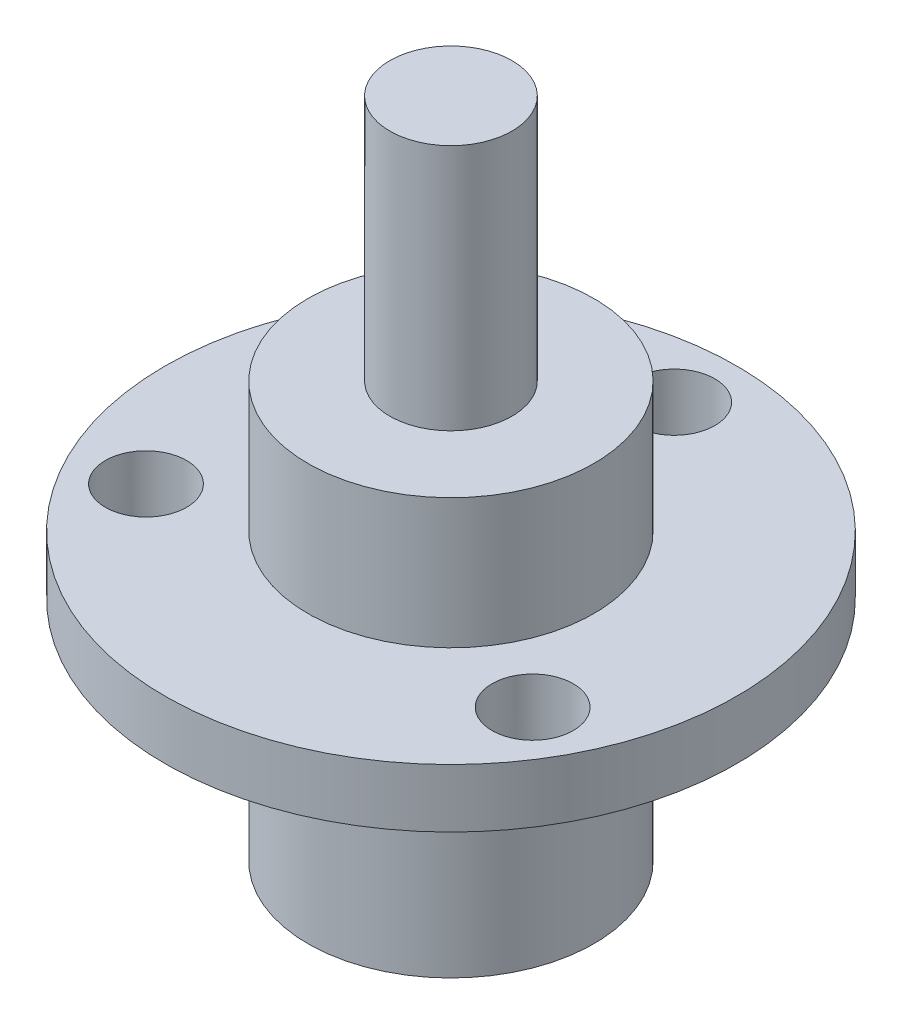
ISO-10303-21;
HEADER;
FILE_DESCRIPTION(('STEP AP214'),'2;1');
FILE_NAME('part.step','',(''),(''),'','','');
FILE_SCHEMA(('AUTOMOTIVE_DESIGN { 1 0 10303 214 1 1 1 1 }'));
ENDSEC;
DATA;
#1=APPLICATION_CONTEXT('core data for automotive mechanical design processes');
#2=APPLICATION_PROTOCOL_DEFINITION('international standard','automotive_design',2000,#1);
#3=PRODUCT_CONTEXT('',#1,'mechanical');
#4=PRODUCT('Part','Part','',(#3));
#5=PRODUCT_RELATED_PRODUCT_CATEGORY('part','',(#4));
#6=PRODUCT_DEFINITION_FORMATION('','',#4);
#7=PRODUCT_DEFINITION_CONTEXT('part definition',#1,'design');
#8=PRODUCT_DEFINITION('design','',#6,#7);
#9=PRODUCT_DEFINITION_SHAPE('','',#8);
#10=(LENGTH_UNIT() NAMED_UNIT(*) SI_UNIT(.MILLI.,.METRE.));
#11=(NAMED_UNIT(*) PLANE_ANGLE_UNIT() SI_UNIT($,.RADIAN.));
#12=(NAMED_UNIT(*) SI_UNIT($,.STERADIAN.) SOLID_ANGLE_UNIT());
#13=UNCERTAINTY_MEASURE_WITH_UNIT(LENGTH_MEASURE(1.E-05),#10,'distance_accuracy_value','');
#14=(GEOMETRIC_REPRESENTATION_CONTEXT(3) GLOBAL_UNCERTAINTY_ASSIGNED_CONTEXT((#13)) GLOBAL_UNIT_ASSIGNED_CONTEXT((#10,
#11,#12)) REPRESENTATION_CONTEXT('',''));
#15=CARTESIAN_POINT('',(0.,0.,0.));
#16=DIRECTION('',(0.,0.,1.));
#17=DIRECTION('',(1.,0.,0.));
#18=AXIS2_PLACEMENT_3D('',#15,#16,#17);
#19=CARTESIAN_POINT('',(0.,0.,0.));
#20=DIRECTION('',(0.,-1.,0.));
#21=DIRECTION('',(1.,0.,0.));
#22=AXIS2_PLACEMENT_3D('',#19,#20,#21);
#23=PLANE('',#22);
#24=CARTESIAN_POINT('',(0.,0.,0.));
#25=DIRECTION('',(0.,1.,0.));
#26=DIRECTION('',(-1.,0.,0.));
#27=AXIS2_PLACEMENT_3D('',#24,#25,#26);
#28=CIRCLE('',#27,5.588);
#29=CARTESIAN_POINT('',(-5.58799999999999,0.,0.));
#30=VERTEX_POINT('',#29);
#31=EDGE_CURVE('E10',#30,#30,#28,.T.);
#32=ORIENTED_EDGE('',*,*,#31,.F.);
#33=EDGE_LOOP('',(#32));
#34=FACE_BOUND('',#33,.T.);
#35=ADVANCED_FACE('F30',(#34),#23,.T.);
#36=CARTESIAN_POINT('',(0.,25.908,0.));
#37=DIRECTION('',(0.,1.,0.));
#38=DIRECTION('',(-1.,0.,0.));
#39=AXIS2_PLACEMENT_3D('',#36,#37,#38);
#40=CYLINDRICAL_SURFACE('',#39,5.588);
#41=ORIENTED_EDGE('',*,*,#31,.T.);
#42=EDGE_LOOP('',(#41));
#43=FACE_BOUND('',#42,.T.);
#44=CARTESIAN_POINT('',(0.,8.89,0.));
#45=DIRECTION('',(0.,1.,0.));
#46=DIRECTION('',(-1.,0.,0.));
#47=AXIS2_PLACEMENT_3D('',#44,#45,#46);
#48=CIRCLE('',#47,5.588);
#49=CARTESIAN_POINT('',(-5.58799999999999,8.89,0.));
#50=VERTEX_POINT('',#49);
#51=EDGE_CURVE('E36',#50,#50,#48,.T.);
#52=ORIENTED_EDGE('',*,*,#51,.F.);
#53=EDGE_LOOP('',(#52));
#54=FACE_BOUND('',#53,.T.);
#55=ADVANCED_FACE('F124',(#43,#54),#40,.T.);
#56=CARTESIAN_POINT('',(-5.58799999999999,8.89,0.));
#57=DIRECTION('',(0.,-1.,0.));
#58=DIRECTION('',(1.,0.,0.));
#59=AXIS2_PLACEMENT_3D('',#56,#57,#58);
#60=PLANE('',#59);
#61=CARTESIAN_POINT('',(7.55598504547889,8.89,4.36244999999993));
#62=DIRECTION('',(0.,-1.,0.));
#63=DIRECTION('',(1.,0.,0.));
#64=AXIS2_PLACEMENT_3D('',#61,#62,#63);
#65=CIRCLE('',#64,1.5875);
#66=CARTESIAN_POINT('',(9.14348504547889,8.89,4.36244999999993));
#67=VERTEX_POINT('',#66);
#68=EDGE_CURVE('E73',#67,#67,#65,.T.);
#69=ORIENTED_EDGE('',*,*,#68,.F.);
#70=EDGE_LOOP('',(#69));
#71=FACE_BOUND('',#70,.T.);
#72=CARTESIAN_POINT('',(-7.55598504547883,8.89,4.36245000000004));
#73=DIRECTION('',(0.,-1.,0.));
#74=DIRECTION('',(1.,0.,0.));
#75=AXIS2_PLACEMENT_3D('',#72,#73,#74);
#76=CIRCLE('',#75,1.5875);
#77=CARTESIAN_POINT('',(-5.96848504547883,8.89,4.36245000000004));
#78=VERTEX_POINT('',#77);
#79=EDGE_CURVE('E67',#78,#78,#76,.T.);
#80=ORIENTED_EDGE('',*,*,#79,.F.);
#81=EDGE_LOOP('',(#80));
#82=FACE_BOUND('',#81,.T.);
#83=CARTESIAN_POINT('',(0.,8.89,-8.7249));
#84=DIRECTION('',(0.,-1.,0.));
#85=DIRECTION('',(1.,0.,0.));
#86=AXIS2_PLACEMENT_3D('',#83,#84,#85);
#87=CIRCLE('',#86,1.5875);
#88=CARTESIAN_POINT('',(1.5875,8.89,-8.7249));
#89=VERTEX_POINT('',#88);
#90=EDGE_CURVE('E61',#89,#89,#87,.T.);
#91=ORIENTED_EDGE('',*,*,#90,.F.);
#92=EDGE_LOOP('',(#91));
#93=FACE_BOUND('',#92,.T.);
#94=ORIENTED_EDGE('',*,*,#51,.T.);
#95=EDGE_LOOP('',(#94));
#96=FACE_BOUND('',#95,.T.);
#97=CARTESIAN_POINT('',(0.,8.89,0.));
#98=DIRECTION('',(0.,1.,0.));
#99=DIRECTION('',(-1.,0.,0.));
#100=AXIS2_PLACEMENT_3D('',#97,#98,#99);
#101=CIRCLE('',#100,11.176);
#102=CARTESIAN_POINT('',(-11.176,8.89,0.));
#103=VERTEX_POINT('',#102);
#104=EDGE_CURVE('E40',#103,#103,#101,.T.);
#105=ORIENTED_EDGE('',*,*,#104,.F.);
#106=EDGE_LOOP('',(#105));
#107=FACE_BOUND('',#106,.T.);
#108=ADVANCED_FACE('F129',(#71,#82,#93,#96,#107),#60,.T.);
#109=CARTESIAN_POINT('',(0.,25.908,0.));
#110=DIRECTION('',(0.,1.,0.));
#111=DIRECTION('',(-1.,0.,0.));
#112=AXIS2_PLACEMENT_3D('',#109,#110,#111);
#113=CYLINDRICAL_SURFACE('',#112,11.176);
#114=ORIENTED_EDGE('',*,*,#104,.T.);
#115=EDGE_LOOP('',(#114));
#116=FACE_BOUND('',#115,.T.);
#117=CARTESIAN_POINT('',(0.,11.176,0.));
#118=DIRECTION('',(0.,1.,0.));
#119=DIRECTION('',(-1.,0.,0.));
#120=AXIS2_PLACEMENT_3D('',#117,#118,#119);
#121=CIRCLE('',#120,11.176);
#122=CARTESIAN_POINT('',(-11.176,11.176,0.));
#123=VERTEX_POINT('',#122);
#124=EDGE_CURVE('E44',#123,#123,#121,.T.);
#125=ORIENTED_EDGE('',*,*,#124,.F.);
#126=EDGE_LOOP('',(#125));
#127=FACE_BOUND('',#126,.T.);
#128=ADVANCED_FACE('F86',(#116,#127),#113,.T.);
#129=CARTESIAN_POINT('',(-11.176,11.176,0.));
#130=DIRECTION('',(0.,1.,0.));
#131=DIRECTION('',(-1.,0.,0.));
#132=AXIS2_PLACEMENT_3D('',#129,#130,#131);
#133=PLANE('',#132);
#134=CARTESIAN_POINT('',(7.55598504547889,11.176,4.36244999999993));
#135=DIRECTION('',(0.,1.,0.));
#136=DIRECTION('',(0.499999999999992,0.,-0.866025403784443));
#137=AXIS2_PLACEMENT_3D('',#134,#135,#136);
#138=CIRCLE('',#137,1.5875);
#139=CARTESIAN_POINT('',(8.34973504547888,11.176,2.98763467149213));
#140=VERTEX_POINT('',#139);
#141=EDGE_CURVE('E76',#140,#140,#138,.T.);
#142=ORIENTED_EDGE('',*,*,#141,.F.);
#143=EDGE_LOOP('',(#142));
#144=FACE_BOUND('',#143,.T.);
#145=CARTESIAN_POINT('',(-7.55598504547883,11.176,4.36245000000004));
#146=DIRECTION('',(0.,1.,0.));
#147=DIRECTION('',(0.500000000000004,0.,0.866025403784436));
#148=AXIS2_PLACEMENT_3D('',#145,#146,#147);
#149=CIRCLE('',#148,1.5875);
#150=CARTESIAN_POINT('',(-6.76223504547882,11.176,5.73726532850783));
#151=VERTEX_POINT('',#150);
#152=EDGE_CURVE('E70',#151,#151,#149,.T.);
#153=ORIENTED_EDGE('',*,*,#152,.F.);
#154=EDGE_LOOP('',(#153));
#155=FACE_BOUND('',#154,.T.);
#156=CARTESIAN_POINT('',(0.,11.176,-8.7249));
#157=DIRECTION('',(0.,1.,0.));
#158=DIRECTION('',(-1.,0.,0.));
#159=AXIS2_PLACEMENT_3D('',#156,#157,#158);
#160=CIRCLE('',#159,1.5875);
#161=CARTESIAN_POINT('',(-1.5875,11.176,-8.7249));
#162=VERTEX_POINT('',#161);
#163=EDGE_CURVE('E64',#162,#162,#160,.T.);
#164=ORIENTED_EDGE('',*,*,#163,.F.);
#165=EDGE_LOOP('',(#164));
#166=FACE_BOUND('',#165,.T.);
#167=ORIENTED_EDGE('',*,*,#124,.T.);
#168=EDGE_LOOP('',(#167));
#169=FACE_BOUND('',#168,.T.);
#170=CARTESIAN_POINT('',(0.,11.176,0.));
#171=DIRECTION('',(0.,1.,0.));
#172=DIRECTION('',(-1.,0.,0.));
#173=AXIS2_PLACEMENT_3D('',#170,#171,#172);
#174=CIRCLE('',#173,5.58799999999999);
#175=CARTESIAN_POINT('',(-5.58799999999999,11.176,0.));
#176=VERTEX_POINT('',#175);
#177=EDGE_CURVE('E49',#176,#176,#174,.T.);
#178=ORIENTED_EDGE('',*,*,#177,.F.);
#179=EDGE_LOOP('',(#178));
#180=FACE_BOUND('',#179,.T.);
#181=ADVANCED_FACE('F82',(#144,#155,#166,#169,#180),#133,.T.);
#182=CARTESIAN_POINT('',(0.,25.908,0.));
#183=DIRECTION('',(0.,1.,0.));
#184=DIRECTION('',(-1.,0.,0.));
#185=AXIS2_PLACEMENT_3D('',#182,#183,#184);
#186=CYLINDRICAL_SURFACE('',#185,5.58799999999999);
#187=ORIENTED_EDGE('',*,*,#177,.T.);
#188=EDGE_LOOP('',(#187));
#189=FACE_BOUND('',#188,.T.);
#190=CARTESIAN_POINT('',(0.,16.256,0.));
#191=DIRECTION('',(0.,1.,0.));
#192=DIRECTION('',(-1.,0.,0.));
#193=AXIS2_PLACEMENT_3D('',#190,#191,#192);
#194=CIRCLE('',#193,5.58799999999999);
#195=CARTESIAN_POINT('',(-5.58799999999999,16.256,0.));
#196=VERTEX_POINT('',#195);
#197=EDGE_CURVE('E52',#196,#196,#194,.T.);
#198=ORIENTED_EDGE('',*,*,#197,.F.);
#199=EDGE_LOOP('',(#198));
#200=FACE_BOUND('',#199,.T.);
#201=ADVANCED_FACE('F85',(#189,#200),#186,.T.);
#202=CARTESIAN_POINT('',(-5.58799999999999,16.256,0.));
#203=DIRECTION('',(0.,1.,0.));
#204=DIRECTION('',(-1.,0.,0.));
#205=AXIS2_PLACEMENT_3D('',#202,#203,#204);
#206=PLANE('',#205);
#207=ORIENTED_EDGE('',*,*,#197,.T.);
#208=EDGE_LOOP('',(#207));
#209=FACE_BOUND('',#208,.T.);
#210=CARTESIAN_POINT('',(0.,16.256,0.));
#211=DIRECTION('',(0.,1.,0.));
#212=DIRECTION('',(-1.,0.,0.));
#213=AXIS2_PLACEMENT_3D('',#210,#211,#212);
#214=CIRCLE('',#213,2.3876);
#215=CARTESIAN_POINT('',(-2.3876,16.256,0.));
#216=VERTEX_POINT('',#215);
#217=EDGE_CURVE('E55',#216,#216,#214,.T.);
#218=ORIENTED_EDGE('',*,*,#217,.F.);
#219=EDGE_LOOP('',(#218));
#220=FACE_BOUND('',#219,.T.);
#221=ADVANCED_FACE('F98',(#209,#220),#206,.T.);
#222=CARTESIAN_POINT('',(0.,25.908,0.));
#223=DIRECTION('',(0.,1.,0.));
#224=DIRECTION('',(-1.,0.,0.));
#225=AXIS2_PLACEMENT_3D('',#222,#223,#224);
#226=CYLINDRICAL_SURFACE('',#225,2.3876);
#227=ORIENTED_EDGE('',*,*,#217,.T.);
#228=EDGE_LOOP('',(#227));
#229=FACE_BOUND('',#228,.T.);
#230=CARTESIAN_POINT('',(0.,25.908,0.));
#231=DIRECTION('',(0.,1.,0.));
#232=DIRECTION('',(-1.,0.,0.));
#233=AXIS2_PLACEMENT_3D('',#230,#231,#232);
#234=CIRCLE('',#233,2.3876);
#235=CARTESIAN_POINT('',(-2.3876,25.908,0.));
#236=VERTEX_POINT('',#235);
#237=EDGE_CURVE('E58',#236,#236,#234,.T.);
#238=ORIENTED_EDGE('',*,*,#237,.F.);
#239=EDGE_LOOP('',(#238));
#240=FACE_BOUND('',#239,.T.);
#241=ADVANCED_FACE('F104',(#229,#240),#226,.T.);
#242=CARTESIAN_POINT('',(-2.3876,25.908,0.));
#243=DIRECTION('',(0.,1.,0.));
#244=DIRECTION('',(-1.,0.,0.));
#245=AXIS2_PLACEMENT_3D('',#242,#243,#244);
#246=PLANE('',#245);
#247=ORIENTED_EDGE('',*,*,#237,.T.);
#248=EDGE_LOOP('',(#247));
#249=FACE_BOUND('',#248,.T.);
#250=ADVANCED_FACE('F110',(#249),#246,.T.);
#251=CARTESIAN_POINT('',(0.,0.,-8.7249));
#252=DIRECTION('',(0.,1.,0.));
#253=DIRECTION('',(-1.,0.,0.));
#254=AXIS2_PLACEMENT_3D('',#251,#252,#253);
#255=CYLINDRICAL_SURFACE('',#254,1.5875);
#256=ORIENTED_EDGE('',*,*,#90,.T.);
#257=EDGE_LOOP('',(#256));
#258=FACE_BOUND('',#257,.T.);
#259=ORIENTED_EDGE('',*,*,#163,.T.);
#260=EDGE_LOOP('',(#259));
#261=FACE_BOUND('',#260,.T.);
#262=ADVANCED_FACE('F115',(#258,#261),#255,.F.);
#263=CARTESIAN_POINT('',(-7.55598504547883,0.,4.36245000000004));
#264=DIRECTION('',(0.,1.,0.));
#265=DIRECTION('',(-1.,0.,0.));
#266=AXIS2_PLACEMENT_3D('',#263,#264,#265);
#267=CYLINDRICAL_SURFACE('',#266,1.5875);
#268=ORIENTED_EDGE('',*,*,#79,.T.);
#269=EDGE_LOOP('',(#268));
#270=FACE_BOUND('',#269,.T.);
#271=ORIENTED_EDGE('',*,*,#152,.T.);
#272=EDGE_LOOP('',(#271));
#273=FACE_BOUND('',#272,.T.);
#274=ADVANCED_FACE('F120',(#270,#273),#267,.F.);
#275=CARTESIAN_POINT('',(7.55598504547889,0.,4.36244999999993));
#276=DIRECTION('',(0.,1.,0.));
#277=DIRECTION('',(-1.,0.,0.));
#278=AXIS2_PLACEMENT_3D('',#275,#276,#277);
#279=CYLINDRICAL_SURFACE('',#278,1.5875);
#280=ORIENTED_EDGE('',*,*,#68,.T.);
#281=EDGE_LOOP('',(#280));
#282=FACE_BOUND('',#281,.T.);
#283=ORIENTED_EDGE('',*,*,#141,.T.);
#284=EDGE_LOOP('',(#283));
#285=FACE_BOUND('',#284,.T.);
#286=ADVANCED_FACE('F80',(#282,#285),#279,.F.);
#287=CLOSED_SHELL('',(#35,#55,#108,#128,#181,#201,#221,#241,#250,#262,#274,#286));
#288=MANIFOLD_SOLID_BREP('B2',#287);
#289=ADVANCED_BREP_SHAPE_REPRESENTATION('',(#18,#288),#14);
#290=SHAPE_DEFINITION_REPRESENTATION(#9,#289);
ENDSEC;
END-ISO-10303-21;
